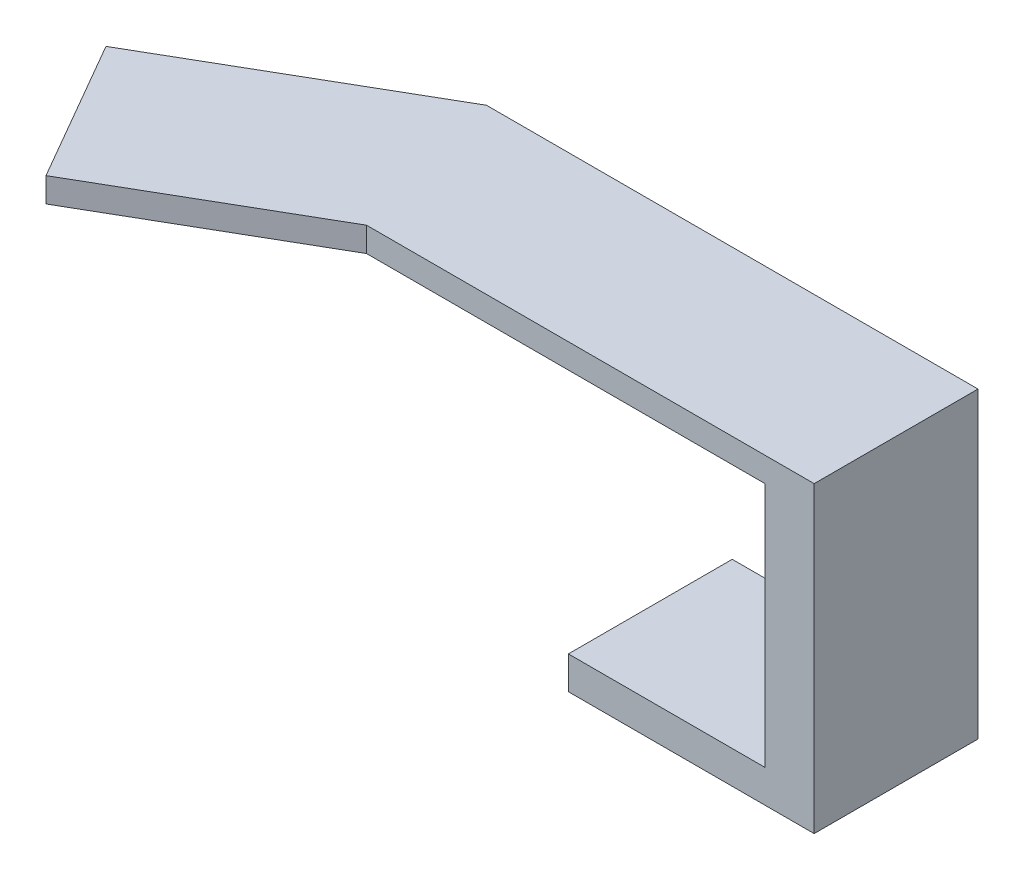
ISO-10303-21;
HEADER;
FILE_DESCRIPTION(('STEP AP214'),'2;1');
FILE_NAME('part.step','',(''),(''),'','','');
FILE_SCHEMA(('AUTOMOTIVE_DESIGN { 1 0 10303 214 1 1 1 1 }'));
ENDSEC;
DATA;
#1=APPLICATION_CONTEXT('core data for automotive mechanical design processes');
#2=APPLICATION_PROTOCOL_DEFINITION('international standard','automotive_design',2000,#1);
#3=PRODUCT_CONTEXT('',#1,'mechanical');
#4=PRODUCT('Part','Part','',(#3));
#5=PRODUCT_RELATED_PRODUCT_CATEGORY('part','',(#4));
#6=PRODUCT_DEFINITION_FORMATION('','',#4);
#7=PRODUCT_DEFINITION_CONTEXT('part definition',#1,'design');
#8=PRODUCT_DEFINITION('design','',#6,#7);
#9=PRODUCT_DEFINITION_SHAPE('','',#8);
#10=(LENGTH_UNIT() NAMED_UNIT(*) SI_UNIT(.MILLI.,.METRE.));
#11=(NAMED_UNIT(*) PLANE_ANGLE_UNIT() SI_UNIT($,.RADIAN.));
#12=(NAMED_UNIT(*) SI_UNIT($,.STERADIAN.) SOLID_ANGLE_UNIT());
#13=UNCERTAINTY_MEASURE_WITH_UNIT(LENGTH_MEASURE(1.E-05),#10,'distance_accuracy_value','');
#14=(GEOMETRIC_REPRESENTATION_CONTEXT(3) GLOBAL_UNCERTAINTY_ASSIGNED_CONTEXT((#13)) GLOBAL_UNIT_ASSIGNED_CONTEXT((#10,
#11,#12)) REPRESENTATION_CONTEXT('',''));
#15=CARTESIAN_POINT('',(0.,0.,0.));
#16=DIRECTION('',(0.,0.,1.));
#17=DIRECTION('',(1.,0.,0.));
#18=AXIS2_PLACEMENT_3D('',#15,#16,#17);
#19=CARTESIAN_POINT('',(16.3933982822018,-17.,6.46446609406726));
#20=DIRECTION('',(1.,0.,0.));
#21=DIRECTION('',(0.,0.,-1.));
#22=AXIS2_PLACEMENT_3D('',#19,#20,#21);
#23=PLANE('',#22);
#24=DIRECTION('',(0.,0.,-1.));
#25=VECTOR('',#24,1.);
#26=CARTESIAN_POINT('',(16.3933982822018,-15.,-3.53553390593274));
#27=LINE('',#26,#25);
#28=CARTESIAN_POINT('',(16.3933982822018,-15.,6.46446609406726));
#29=VERTEX_POINT('',#28);
#30=CARTESIAN_POINT('',(16.3933982822018,-15.,-3.53553390593274));
#31=VERTEX_POINT('',#30);
#32=EDGE_CURVE('E178',#29,#31,#27,.T.);
#33=ORIENTED_EDGE('',*,*,#32,.F.);
#34=DIRECTION('',(0.,1.,0.));
#35=VECTOR('',#34,1.);
#36=CARTESIAN_POINT('',(16.3933982822018,-17.,6.46446609406726));
#37=LINE('',#36,#35);
#38=CARTESIAN_POINT('',(16.3933982822018,0.,6.46446609406726));
#39=VERTEX_POINT('',#38);
#40=EDGE_CURVE('E48',#29,#39,#37,.T.);
#41=ORIENTED_EDGE('',*,*,#40,.T.);
#42=DIRECTION('',(0.,0.,-1.));
#43=VECTOR('',#42,1.);
#44=CARTESIAN_POINT('',(16.3933982822018,0.,6.46446609406726));
#45=LINE('',#44,#43);
#46=CARTESIAN_POINT('',(16.3933982822018,0.,-3.53553390593274));
#47=VERTEX_POINT('',#46);
#48=EDGE_CURVE('E142',#39,#47,#45,.T.);
#49=ORIENTED_EDGE('',*,*,#48,.T.);
#50=DIRECTION('',(0.,1.,0.));
#51=VECTOR('',#50,1.);
#52=CARTESIAN_POINT('',(16.3933982822018,-17.,-3.53553390593274));
#53=LINE('',#52,#51);
#54=EDGE_CURVE('E161',#31,#47,#53,.T.);
#55=ORIENTED_EDGE('',*,*,#54,.F.);
#56=EDGE_LOOP('',(#33,#41,#49,#55));
#57=FACE_BOUND('',#56,.T.);
#58=ADVANCED_FACE('F33',(#57),#23,.F.);
#59=CARTESIAN_POINT('',(19.3933982822018,1.5,6.46446609406726));
#60=DIRECTION('',(-1.,0.,0.));
#61=DIRECTION('',(0.,0.,1.));
#62=AXIS2_PLACEMENT_3D('',#59,#60,#61);
#63=PLANE('',#62);
#64=DIRECTION('',(0.,-1.,0.));
#65=VECTOR('',#64,1.);
#66=CARTESIAN_POINT('',(19.3933982822018,1.5,6.46446609406726));
#67=LINE('',#66,#65);
#68=CARTESIAN_POINT('',(19.3933982822018,1.5,6.46446609406726));
#69=VERTEX_POINT('',#68);
#70=CARTESIAN_POINT('',(19.3933982822018,-17.,6.46446609406726));
#71=VERTEX_POINT('',#70);
#72=EDGE_CURVE('E117',#69,#71,#67,.T.);
#73=ORIENTED_EDGE('',*,*,#72,.T.);
#74=DIRECTION('',(0.,0.,1.));
#75=VECTOR('',#74,1.);
#76=CARTESIAN_POINT('',(19.3933982822018,-17.,6.46446609406726));
#77=LINE('',#76,#75);
#78=CARTESIAN_POINT('',(19.3933982822018,-17.,-3.53553390593274));
#79=VERTEX_POINT('',#78);
#80=EDGE_CURVE('E166',#79,#71,#77,.T.);
#81=ORIENTED_EDGE('',*,*,#80,.F.);
#82=DIRECTION('',(0.,-1.,0.));
#83=VECTOR('',#82,1.);
#84=CARTESIAN_POINT('',(19.3933982822018,1.5,-3.53553390593274));
#85=LINE('',#84,#83);
#86=CARTESIAN_POINT('',(19.3933982822018,1.5,-3.53553390593274));
#87=VERTEX_POINT('',#86);
#88=EDGE_CURVE('E11',#87,#79,#85,.T.);
#89=ORIENTED_EDGE('',*,*,#88,.F.);
#90=DIRECTION('',(0.,0.,-1.));
#91=VECTOR('',#90,1.);
#92=CARTESIAN_POINT('',(19.3933982822018,1.5,6.46446609406726));
#93=LINE('',#92,#91);
#94=EDGE_CURVE('E130',#69,#87,#93,.T.);
#95=ORIENTED_EDGE('',*,*,#94,.F.);
#96=EDGE_LOOP('',(#73,#81,#89,#95));
#97=FACE_BOUND('',#96,.T.);
#98=ADVANCED_FACE('F35',(#97),#63,.F.);
#99=CARTESIAN_POINT('',(-10.6066017177982,1.5,-3.53553390593274));
#100=DIRECTION('',(0.,0.,1.));
#101=DIRECTION('',(1.,0.,0.));
#102=AXIS2_PLACEMENT_3D('',#99,#100,#101);
#103=PLANE('',#102);
#104=ORIENTED_EDGE('',*,*,#88,.T.);
#105=DIRECTION('',(1.,0.,0.));
#106=VECTOR('',#105,1.);
#107=CARTESIAN_POINT('',(19.3933982822018,-17.,-3.53553390593274));
#108=LINE('',#107,#106);
#109=CARTESIAN_POINT('',(4.39339828220179,-17.,-3.53553390593274));
#110=VERTEX_POINT('',#109);
#111=EDGE_CURVE('E164',#110,#79,#108,.T.);
#112=ORIENTED_EDGE('',*,*,#111,.F.);
#113=DIRECTION('',(0.,-1.,0.));
#114=VECTOR('',#113,1.);
#115=CARTESIAN_POINT('',(4.39339828220179,-17.,-3.53553390593274));
#116=LINE('',#115,#114);
#117=CARTESIAN_POINT('',(4.39339828220179,-15.,-3.53553390593274));
#118=VERTEX_POINT('',#117);
#119=EDGE_CURVE('E181',#118,#110,#116,.T.);
#120=ORIENTED_EDGE('',*,*,#119,.F.);
#121=DIRECTION('',(1.,0.,0.));
#122=VECTOR('',#121,1.);
#123=CARTESIAN_POINT('',(4.39339828220179,-15.,-3.53553390593274));
#124=LINE('',#123,#122);
#125=EDGE_CURVE('E174',#118,#31,#124,.T.);
#126=ORIENTED_EDGE('',*,*,#125,.T.);
#127=ORIENTED_EDGE('',*,*,#54,.T.);
#128=DIRECTION('',(-1.,0.,0.));
#129=VECTOR('',#128,1.);
#130=CARTESIAN_POINT('',(-10.6066017177982,0.,-3.53553390593274));
#131=LINE('',#130,#129);
#132=CARTESIAN_POINT('',(-10.6066017177982,0.,-3.53553390593274));
#133=VERTEX_POINT('',#132);
#134=EDGE_CURVE('E121',#47,#133,#131,.T.);
#135=ORIENTED_EDGE('',*,*,#134,.T.);
#136=DIRECTION('',(0.,-1.,0.));
#137=VECTOR('',#136,1.);
#138=CARTESIAN_POINT('',(-10.6066017177982,1.5,-3.53553390593274));
#139=LINE('',#138,#137);
#140=CARTESIAN_POINT('',(-10.6066017177982,1.5,-3.53553390593274));
#141=VERTEX_POINT('',#140);
#142=EDGE_CURVE('E41',#141,#133,#139,.T.);
#143=ORIENTED_EDGE('',*,*,#142,.F.);
#144=DIRECTION('',(-1.,0.,0.));
#145=VECTOR('',#144,1.);
#146=CARTESIAN_POINT('',(-10.6066017177982,1.5,-3.53553390593274));
#147=LINE('',#146,#145);
#148=EDGE_CURVE('E87',#87,#141,#147,.T.);
#149=ORIENTED_EDGE('',*,*,#148,.F.);
#150=EDGE_LOOP('',(#104,#112,#120,#126,#127,#135,#143,#149));
#151=FACE_BOUND('',#150,.T.);
#152=ADVANCED_FACE('F203',(#151),#103,.F.);
#153=CARTESIAN_POINT('',(-10.6066017177982,1.5,-3.53553390593274));
#154=DIRECTION('',(0.499999999999995,0.,0.866025403784441));
#155=DIRECTION('',(0.866025403784442,0.,-0.499999999999995));
#156=AXIS2_PLACEMENT_3D('',#153,#154,#155);
#157=PLANE('',#156);
#158=DIRECTION('',(-0.866025403784442,0.,0.499999999999995));
#159=VECTOR('',#158,1.);
#160=CARTESIAN_POINT('',(-10.6066017177982,0.,-3.53553390593274));
#161=LINE('',#160,#159);
#162=CARTESIAN_POINT('',(-25.3290335821337,0.,4.96446609406717));
#163=VERTEX_POINT('',#162);
#164=EDGE_CURVE('E123',#133,#163,#161,.T.);
#165=ORIENTED_EDGE('',*,*,#164,.T.);
#166=DIRECTION('',(0.,-1.,0.));
#167=VECTOR('',#166,1.);
#168=CARTESIAN_POINT('',(-25.3290335821337,1.5,4.96446609406717));
#169=LINE('',#168,#167);
#170=CARTESIAN_POINT('',(-25.3290335821337,1.5,4.96446609406717));
#171=VERTEX_POINT('',#170);
#172=EDGE_CURVE('E112',#171,#163,#169,.T.);
#173=ORIENTED_EDGE('',*,*,#172,.F.);
#174=DIRECTION('',(-0.866025403784442,0.,0.499999999999995));
#175=VECTOR('',#174,1.);
#176=CARTESIAN_POINT('',(-10.6066017177982,1.5,-3.53553390593274));
#177=LINE('',#176,#175);
#178=EDGE_CURVE('E103',#141,#171,#177,.T.);
#179=ORIENTED_EDGE('',*,*,#178,.F.);
#180=ORIENTED_EDGE('',*,*,#142,.T.);
#181=EDGE_LOOP('',(#165,#173,#179,#180));
#182=FACE_BOUND('',#181,.T.);
#183=ADVANCED_FACE('F137',(#182),#157,.F.);
#184=CARTESIAN_POINT('',(-25.3290335821337,1.5,4.96446609406717));
#185=DIRECTION('',(0.866025403784441,0.,-0.499999999999996));
#186=DIRECTION('',(-0.499999999999996,0.,-0.866025403784441));
#187=AXIS2_PLACEMENT_3D('',#184,#185,#186);
#188=PLANE('',#187);
#189=DIRECTION('',(0.499999999999996,0.,0.866025403784441));
#190=VECTOR('',#189,1.);
#191=CARTESIAN_POINT('',(-25.3290335821337,0.,4.96446609406717));
#192=LINE('',#191,#190);
#193=CARTESIAN_POINT('',(-20.3290335821338,0.,13.6247201319116));
#194=VERTEX_POINT('',#193);
#195=EDGE_CURVE('E111',#163,#194,#192,.T.);
#196=ORIENTED_EDGE('',*,*,#195,.T.);
#197=DIRECTION('',(0.,-1.,0.));
#198=VECTOR('',#197,1.);
#199=CARTESIAN_POINT('',(-20.3290335821338,1.5,13.6247201319116));
#200=LINE('',#199,#198);
#201=CARTESIAN_POINT('',(-20.3290335821338,1.5,13.6247201319116));
#202=VERTEX_POINT('',#201);
#203=EDGE_CURVE('E108',#202,#194,#200,.T.);
#204=ORIENTED_EDGE('',*,*,#203,.F.);
#205=DIRECTION('',(0.499999999999996,0.,0.866025403784441));
#206=VECTOR('',#205,1.);
#207=CARTESIAN_POINT('',(-25.3290335821337,1.5,4.96446609406717));
#208=LINE('',#207,#206);
#209=EDGE_CURVE('E97',#171,#202,#208,.T.);
#210=ORIENTED_EDGE('',*,*,#209,.F.);
#211=ORIENTED_EDGE('',*,*,#172,.T.);
#212=EDGE_LOOP('',(#196,#204,#210,#211));
#213=FACE_BOUND('',#212,.T.);
#214=ADVANCED_FACE('F109',(#213),#188,.F.);
#215=CARTESIAN_POINT('',(-20.3290335821338,1.5,13.6247201319116));
#216=DIRECTION('',(-0.499999999999995,0.,-0.866025403784441));
#217=DIRECTION('',(-0.866025403784442,0.,0.499999999999995));
#218=AXIS2_PLACEMENT_3D('',#215,#216,#217);
#219=PLANE('',#218);
#220=DIRECTION('',(0.866025403784441,0.,-0.499999999999995));
#221=VECTOR('',#220,1.);
#222=CARTESIAN_POINT('',(-20.3290335821338,0.,13.6247201319116));
#223=LINE('',#222,#221);
#224=CARTESIAN_POINT('',(-7.92710979348702,0.,6.46446609406726));
#225=VERTEX_POINT('',#224);
#226=EDGE_CURVE('E79',#194,#225,#223,.T.);
#227=ORIENTED_EDGE('',*,*,#226,.T.);
#228=DIRECTION('',(0.,-1.,0.));
#229=VECTOR('',#228,1.);
#230=CARTESIAN_POINT('',(-7.92710979348702,1.5,6.46446609406726));
#231=LINE('',#230,#229);
#232=CARTESIAN_POINT('',(-7.92710979348702,1.5,6.46446609406726));
#233=VERTEX_POINT('',#232);
#234=EDGE_CURVE('E113',#233,#225,#231,.T.);
#235=ORIENTED_EDGE('',*,*,#234,.F.);
#236=DIRECTION('',(0.866025403784441,0.,-0.499999999999995));
#237=VECTOR('',#236,1.);
#238=CARTESIAN_POINT('',(-20.3290335821338,1.5,13.6247201319116));
#239=LINE('',#238,#237);
#240=EDGE_CURVE('E101',#202,#233,#239,.T.);
#241=ORIENTED_EDGE('',*,*,#240,.F.);
#242=ORIENTED_EDGE('',*,*,#203,.T.);
#243=EDGE_LOOP('',(#227,#235,#241,#242));
#244=FACE_BOUND('',#243,.T.);
#245=ADVANCED_FACE('F115',(#244),#219,.F.);
#246=CARTESIAN_POINT('',(-7.92710979348702,1.5,6.46446609406726));
#247=DIRECTION('',(0.,0.,-1.));
#248=DIRECTION('',(-1.,0.,0.));
#249=AXIS2_PLACEMENT_3D('',#246,#247,#248);
#250=PLANE('',#249);
#251=DIRECTION('',(1.,0.,0.));
#252=VECTOR('',#251,1.);
#253=CARTESIAN_POINT('',(-7.92710979348702,0.,6.46446609406726));
#254=LINE('',#253,#252);
#255=EDGE_CURVE('E127',#225,#39,#254,.T.);
#256=ORIENTED_EDGE('',*,*,#255,.T.);
#257=ORIENTED_EDGE('',*,*,#40,.F.);
#258=DIRECTION('',(1.,0.,0.));
#259=VECTOR('',#258,1.);
#260=CARTESIAN_POINT('',(4.39339828220179,-15.,6.46446609406726));
#261=LINE('',#260,#259);
#262=CARTESIAN_POINT('',(4.39339828220179,-15.,6.46446609406726));
#263=VERTEX_POINT('',#262);
#264=EDGE_CURVE('E167',#263,#29,#261,.T.);
#265=ORIENTED_EDGE('',*,*,#264,.F.);
#266=DIRECTION('',(0.,1.,0.));
#267=VECTOR('',#266,1.);
#268=CARTESIAN_POINT('',(4.39339828220179,-17.,6.46446609406726));
#269=LINE('',#268,#267);
#270=CARTESIAN_POINT('',(4.39339828220179,-17.,6.46446609406726));
#271=VERTEX_POINT('',#270);
#272=EDGE_CURVE('E184',#271,#263,#269,.T.);
#273=ORIENTED_EDGE('',*,*,#272,.F.);
#274=DIRECTION('',(-1.,0.,0.));
#275=VECTOR('',#274,1.);
#276=CARTESIAN_POINT('',(19.3933982822018,-17.,6.46446609406726));
#277=LINE('',#276,#275);
#278=EDGE_CURVE('E152',#71,#271,#277,.T.);
#279=ORIENTED_EDGE('',*,*,#278,.F.);
#280=ORIENTED_EDGE('',*,*,#72,.F.);
#281=DIRECTION('',(1.,0.,0.));
#282=VECTOR('',#281,1.);
#283=CARTESIAN_POINT('',(-7.92710979348702,1.5,6.46446609406726));
#284=LINE('',#283,#282);
#285=EDGE_CURVE('E57',#233,#69,#284,.T.);
#286=ORIENTED_EDGE('',*,*,#285,.F.);
#287=ORIENTED_EDGE('',*,*,#234,.T.);
#288=EDGE_LOOP('',(#256,#257,#265,#273,#279,#280,#286,#287));
#289=FACE_BOUND('',#288,.T.);
#290=ADVANCED_FACE('F144',(#289),#250,.F.);
#291=CARTESIAN_POINT('',(0.,1.5,0.));
#292=DIRECTION('',(0.,-1.,0.));
#293=DIRECTION('',(0.,0.,-1.));
#294=AXIS2_PLACEMENT_3D('',#291,#292,#293);
#295=PLANE('',#294);
#296=ORIENTED_EDGE('',*,*,#94,.T.);
#297=ORIENTED_EDGE('',*,*,#148,.T.);
#298=ORIENTED_EDGE('',*,*,#178,.T.);
#299=ORIENTED_EDGE('',*,*,#209,.T.);
#300=ORIENTED_EDGE('',*,*,#240,.T.);
#301=ORIENTED_EDGE('',*,*,#285,.T.);
#302=EDGE_LOOP('',(#296,#297,#298,#299,#300,#301));
#303=FACE_BOUND('',#302,.T.);
#304=ADVANCED_FACE('F99',(#303),#295,.F.);
#305=CARTESIAN_POINT('',(0.,0.,0.));
#306=DIRECTION('',(0.,-1.,0.));
#307=DIRECTION('',(0.,0.,-1.));
#308=AXIS2_PLACEMENT_3D('',#305,#306,#307);
#309=PLANE('',#308);
#310=ORIENTED_EDGE('',*,*,#48,.F.);
#311=ORIENTED_EDGE('',*,*,#255,.F.);
#312=ORIENTED_EDGE('',*,*,#226,.F.);
#313=ORIENTED_EDGE('',*,*,#195,.F.);
#314=ORIENTED_EDGE('',*,*,#164,.F.);
#315=ORIENTED_EDGE('',*,*,#134,.F.);
#316=EDGE_LOOP('',(#310,#311,#312,#313,#314,#315));
#317=FACE_BOUND('',#316,.T.);
#318=ADVANCED_FACE('F140',(#317),#309,.T.);
#319=CARTESIAN_POINT('',(0.,-17.,0.));
#320=DIRECTION('',(0.,1.,0.));
#321=DIRECTION('',(0.,0.,1.));
#322=AXIS2_PLACEMENT_3D('',#319,#320,#321);
#323=PLANE('',#322);
#324=ORIENTED_EDGE('',*,*,#80,.T.);
#325=ORIENTED_EDGE('',*,*,#278,.T.);
#326=DIRECTION('',(0.,0.,1.));
#327=VECTOR('',#326,1.);
#328=CARTESIAN_POINT('',(4.39339828220179,-17.,-3.53553390593274));
#329=LINE('',#328,#327);
#330=EDGE_CURVE('E187',#110,#271,#329,.T.);
#331=ORIENTED_EDGE('',*,*,#330,.F.);
#332=ORIENTED_EDGE('',*,*,#111,.T.);
#333=EDGE_LOOP('',(#324,#325,#331,#332));
#334=FACE_BOUND('',#333,.T.);
#335=ADVANCED_FACE('F213',(#334),#323,.F.);
#336=CARTESIAN_POINT('',(4.39339828220179,-15.,-3.53553390593274));
#337=DIRECTION('',(0.,-1.,0.));
#338=DIRECTION('',(0.,0.,-1.));
#339=AXIS2_PLACEMENT_3D('',#336,#337,#338);
#340=PLANE('',#339);
#341=ORIENTED_EDGE('',*,*,#32,.T.);
#342=ORIENTED_EDGE('',*,*,#125,.F.);
#343=DIRECTION('',(0.,0.,-1.));
#344=VECTOR('',#343,1.);
#345=CARTESIAN_POINT('',(4.39339828220179,-15.,-3.53553390593274));
#346=LINE('',#345,#344);
#347=EDGE_CURVE('E177',#263,#118,#346,.T.);
#348=ORIENTED_EDGE('',*,*,#347,.F.);
#349=ORIENTED_EDGE('',*,*,#264,.T.);
#350=EDGE_LOOP('',(#341,#342,#348,#349));
#351=FACE_BOUND('',#350,.T.);
#352=ADVANCED_FACE('F215',(#351),#340,.F.);
#353=CARTESIAN_POINT('',(4.39339828220179,0.,0.));
#354=DIRECTION('',(1.,0.,0.));
#355=DIRECTION('',(0.,0.,-1.));
#356=AXIS2_PLACEMENT_3D('',#353,#354,#355);
#357=PLANE('',#356);
#358=ORIENTED_EDGE('',*,*,#119,.T.);
#359=ORIENTED_EDGE('',*,*,#330,.T.);
#360=ORIENTED_EDGE('',*,*,#272,.T.);
#361=ORIENTED_EDGE('',*,*,#347,.T.);
#362=EDGE_LOOP('',(#358,#359,#360,#361));
#363=FACE_BOUND('',#362,.T.);
#364=ADVANCED_FACE('F194',(#363),#357,.F.);
#365=CLOSED_SHELL('',(#58,#98,#152,#183,#214,#245,#290,#304,#318,#335,#352,#364));
#366=MANIFOLD_SOLID_BREP('B2',#365);
#367=ADVANCED_BREP_SHAPE_REPRESENTATION('',(#18,#366),#14);
#368=SHAPE_DEFINITION_REPRESENTATION(#9,#367);
ENDSEC;
END-ISO-10303-21;
